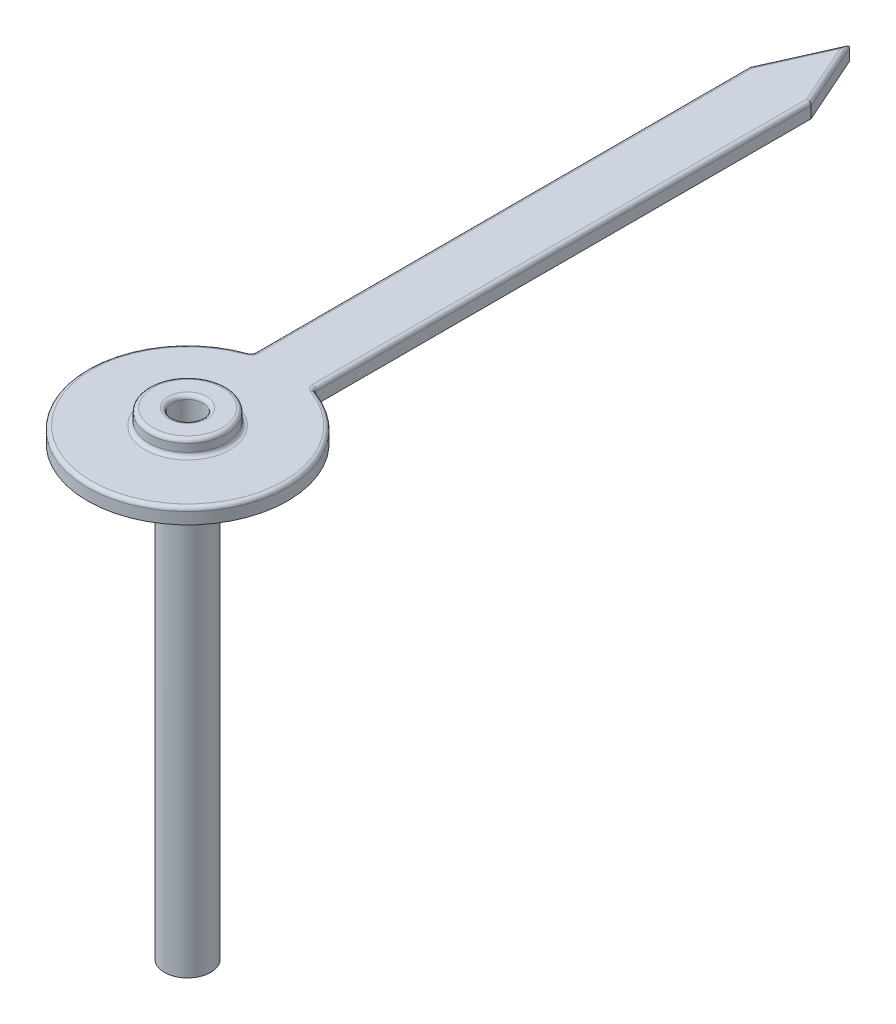
ISO-10303-21;
HEADER;
FILE_DESCRIPTION(('STEP AP214'),'2;1');
FILE_NAME('part.step','',(''),(''),'','','');
FILE_SCHEMA(('AUTOMOTIVE_DESIGN { 1 0 10303 214 1 1 1 1 }'));
ENDSEC;
DATA;
#1=APPLICATION_CONTEXT('core data for automotive mechanical design processes');
#2=APPLICATION_PROTOCOL_DEFINITION('international standard','automotive_design',2000,#1);
#3=PRODUCT_CONTEXT('',#1,'mechanical');
#4=PRODUCT('Part','Part','',(#3));
#5=PRODUCT_RELATED_PRODUCT_CATEGORY('part','',(#4));
#6=PRODUCT_DEFINITION_FORMATION('','',#4);
#7=PRODUCT_DEFINITION_CONTEXT('part definition',#1,'design');
#8=PRODUCT_DEFINITION('design','',#6,#7);
#9=PRODUCT_DEFINITION_SHAPE('','',#8);
#10=(LENGTH_UNIT() NAMED_UNIT(*) SI_UNIT(.MILLI.,.METRE.));
#11=(NAMED_UNIT(*) PLANE_ANGLE_UNIT() SI_UNIT($,.RADIAN.));
#12=(NAMED_UNIT(*) SI_UNIT($,.STERADIAN.) SOLID_ANGLE_UNIT());
#13=UNCERTAINTY_MEASURE_WITH_UNIT(LENGTH_MEASURE(1.E-05),#10,'distance_accuracy_value','');
#14=(GEOMETRIC_REPRESENTATION_CONTEXT(3) GLOBAL_UNCERTAINTY_ASSIGNED_CONTEXT((#13)) GLOBAL_UNIT_ASSIGNED_CONTEXT((#10,
#11,#12)) REPRESENTATION_CONTEXT('',''));
#15=CARTESIAN_POINT('',(0.,0.,0.));
#16=DIRECTION('',(0.,0.,1.));
#17=DIRECTION('',(1.,0.,0.));
#18=AXIS2_PLACEMENT_3D('',#15,#16,#17);
#19=CARTESIAN_POINT('',(-86.5194152002109,-2.9,39.6725020443444));
#20=DIRECTION('',(0.,1.,0.));
#21=DIRECTION('',(0.,0.,1.));
#22=AXIS2_PLACEMENT_3D('',#19,#20,#21);
#23=PLANE('',#22);
#24=CARTESIAN_POINT('',(-86.5194152002109,-2.9,39.6725020443444));
#25=DIRECTION('',(0.,1.,0.));
#26=DIRECTION('',(0.,0.,1.));
#27=AXIS2_PLACEMENT_3D('',#24,#25,#26);
#28=CIRCLE('',#27,0.100000000000009);
#29=CARTESIAN_POINT('',(-86.5194152002109,-2.9,39.7725020443444));
#30=VERTEX_POINT('',#29);
#31=EDGE_CURVE('E137',#30,#30,#28,.T.);
#32=ORIENTED_EDGE('',*,*,#31,.T.);
#33=EDGE_LOOP('',(#32));
#34=FACE_BOUND('',#33,.T.);
#35=CARTESIAN_POINT('',(-86.5194152002109,-2.9,39.6725020443444));
#36=DIRECTION('',(0.,-1.,0.));
#37=DIRECTION('',(0.,0.,-1.));
#38=AXIS2_PLACEMENT_3D('',#35,#36,#37);
#39=CIRCLE('',#38,0.149999999999991);
#40=CARTESIAN_POINT('',(-86.5194152002109,-2.9,39.5225020443444));
#41=VERTEX_POINT('',#40);
#42=EDGE_CURVE('E487',#41,#41,#39,.T.);
#43=ORIENTED_EDGE('',*,*,#42,.T.);
#44=EDGE_LOOP('',(#43));
#45=FACE_BOUND('',#44,.T.);
#46=ADVANCED_FACE('F33',(#34,#45),#23,.F.);
#47=CARTESIAN_POINT('',(-86.5194152002109,0.1,39.6725020443444));
#48=DIRECTION('',(0.,1.,0.));
#49=DIRECTION('',(0.,0.,1.));
#50=AXIS2_PLACEMENT_3D('',#47,#48,#49);
#51=PLANE('',#50);
#52=CARTESIAN_POINT('',(-86.7444152002109,0.1,39.0364527082737));
#53=DIRECTION('',(0.,1.,0.));
#54=DIRECTION('',(0.,0.,1.));
#55=AXIS2_PLACEMENT_3D('',#52,#53,#54);
#56=CIRCLE('',#55,0.05);
#57=CARTESIAN_POINT('',(-86.7277404574065,0.1,39.0835903042287));
#58=VERTEX_POINT('',#57);
#59=CARTESIAN_POINT('',(-86.6944152002109,0.1,39.0364527082737));
#60=VERTEX_POINT('',#59);
#61=EDGE_CURVE('E174',#58,#60,#56,.T.);
#62=ORIENTED_EDGE('',*,*,#61,.F.);
#63=CARTESIAN_POINT('',(-86.5194152002109,0.1,39.6725020443444));
#64=DIRECTION('',(0.,1.,0.));
#65=DIRECTION('',(0.,0.,1.));
#66=AXIS2_PLACEMENT_3D('',#63,#64,#65);
#67=CIRCLE('',#66,0.624673074841349);
#68=CARTESIAN_POINT('',(-86.3110899430152,0.1,39.0835903042287));
#69=VERTEX_POINT('',#68);
#70=EDGE_CURVE('E180',#58,#69,#67,.T.);
#71=ORIENTED_EDGE('',*,*,#70,.T.);
#72=CARTESIAN_POINT('',(-86.2944152002109,0.1,39.0364527082737));
#73=DIRECTION('',(0.,1.,0.));
#74=DIRECTION('',(0.,0.,1.));
#75=AXIS2_PLACEMENT_3D('',#72,#73,#74);
#76=CIRCLE('',#75,0.05);
#77=CARTESIAN_POINT('',(-86.3444152002109,0.1,39.0364527082737));
#78=VERTEX_POINT('',#77);
#79=EDGE_CURVE('E177',#78,#69,#76,.T.);
#80=ORIENTED_EDGE('',*,*,#79,.F.);
#81=DIRECTION('',(0.,0.,-1.));
#82=VECTOR('',#81,1.);
#83=CARTESIAN_POINT('',(-86.3444152002109,0.1,35.8249413528157));
#84=LINE('',#83,#82);
#85=CARTESIAN_POINT('',(-86.3444152002109,0.1,35.8302449444889));
#86=VERTEX_POINT('',#85);
#87=EDGE_CURVE('E171',#78,#86,#84,.T.);
#88=ORIENTED_EDGE('',*,*,#87,.T.);
#89=DIRECTION('',(-0.406014669859027,0.,-0.913866559109844));
#90=VECTOR('',#89,1.);
#91=CARTESIAN_POINT('',(-86.5422618641886,0.1,35.3849274142049));
#92=LINE('',#91,#90);
#93=CARTESIAN_POINT('',(-86.5194152002109,0.1,35.4363511773012));
#94=VERTEX_POINT('',#93);
#95=EDGE_CURVE('E165',#86,#94,#92,.T.);
#96=ORIENTED_EDGE('',*,*,#95,.T.);
#97=DIRECTION('',(-0.40601466985905,0.,0.913866559109833));
#98=VECTOR('',#97,1.);
#99=CARTESIAN_POINT('',(-86.6965685362331,0.1,35.8350917195622));
#100=LINE('',#99,#98);
#101=CARTESIAN_POINT('',(-86.6944152002109,0.1,35.8302449444889));
#102=VERTEX_POINT('',#101);
#103=EDGE_CURVE('E167',#94,#102,#100,.T.);
#104=ORIENTED_EDGE('',*,*,#103,.T.);
#105=DIRECTION('',(0.,0.,1.));
#106=VECTOR('',#105,1.);
#107=CARTESIAN_POINT('',(-86.6944152002109,0.1,39.0543798038661));
#108=LINE('',#107,#106);
#109=EDGE_CURVE('E169',#102,#60,#108,.T.);
#110=ORIENTED_EDGE('',*,*,#109,.T.);
#111=EDGE_LOOP('',(#62,#71,#80,#88,#96,#104,#110));
#112=FACE_BOUND('',#111,.T.);
#113=CARTESIAN_POINT('',(-86.5194152002109,0.1,39.6725020443444));
#114=DIRECTION('',(0.,1.,0.));
#115=DIRECTION('',(0.,0.,1.));
#116=AXIS2_PLACEMENT_3D('',#113,#114,#115);
#117=CIRCLE('',#116,0.275);
#118=CARTESIAN_POINT('',(-86.5194152002109,0.1,39.9475020443444));
#119=VERTEX_POINT('',#118);
#120=EDGE_CURVE('E162',#119,#119,#117,.F.);
#121=ORIENTED_EDGE('',*,*,#120,.T.);
#122=EDGE_LOOP('',(#121));
#123=FACE_BOUND('',#122,.T.);
#124=ADVANCED_FACE('F241',(#112,#123),#51,.T.);
#125=CARTESIAN_POINT('',(-86.5194152002109,0.,39.6725020443444));
#126=DIRECTION('',(0.,1.,0.));
#127=DIRECTION('',(0.,0.,1.));
#128=AXIS2_PLACEMENT_3D('',#125,#126,#127);
#129=PLANE('',#128);
#130=DIRECTION('',(-0.406014669859027,0.,-0.913866559109844));
#131=VECTOR('',#130,1.);
#132=CARTESIAN_POINT('',(-86.3194152002109,0.,35.8249413528157));
#133=LINE('',#132,#131);
#134=CARTESIAN_POINT('',(-86.3194152002109,0.,35.8249413528157));
#135=VERTEX_POINT('',#134);
#136=CARTESIAN_POINT('',(-86.5194152002109,0.,35.3747770474584));
#137=VERTEX_POINT('',#136);
#138=EDGE_CURVE('E130',#135,#137,#133,.T.);
#139=ORIENTED_EDGE('',*,*,#138,.F.);
#140=DIRECTION('',(0.,0.,-1.));
#141=VECTOR('',#140,1.);
#142=CARTESIAN_POINT('',(-86.3194152002109,0.,39.0543798038661));
#143=LINE('',#142,#141);
#144=CARTESIAN_POINT('',(-86.3194152002109,0.,39.0364527082737));
#145=VERTEX_POINT('',#144);
#146=EDGE_CURVE('E147',#145,#135,#143,.T.);
#147=ORIENTED_EDGE('',*,*,#146,.F.);
#148=CARTESIAN_POINT('',(-86.2944152002109,0.,39.0364527082737));
#149=DIRECTION('',(0.,1.,0.));
#150=DIRECTION('',(0.,0.,1.));
#151=AXIS2_PLACEMENT_3D('',#148,#149,#150);
#152=CIRCLE('',#151,0.025);
#153=CARTESIAN_POINT('',(-86.302752571613,0.,39.0600215062512));
#154=VERTEX_POINT('',#153);
#155=EDGE_CURVE('E11',#145,#154,#152,.T.);
#156=ORIENTED_EDGE('',*,*,#155,.T.);
#157=CARTESIAN_POINT('',(-86.5194152002109,0.,39.6725020443444));
#158=DIRECTION('',(0.,1.,0.));
#159=DIRECTION('',(0.,0.,1.));
#160=AXIS2_PLACEMENT_3D('',#157,#158,#159);
#161=CIRCLE('',#160,0.649673074841349);
#162=CARTESIAN_POINT('',(-86.7360778288087,0.,39.0600215062512));
#163=VERTEX_POINT('',#162);
#164=EDGE_CURVE('E144',#163,#154,#161,.T.);
#165=ORIENTED_EDGE('',*,*,#164,.F.);
#166=CARTESIAN_POINT('',(-86.7444152002109,0.,39.0364527082737));
#167=DIRECTION('',(0.,1.,0.));
#168=DIRECTION('',(0.,0.,1.));
#169=AXIS2_PLACEMENT_3D('',#166,#167,#168);
#170=CIRCLE('',#169,0.025);
#171=CARTESIAN_POINT('',(-86.7194152002109,0.,39.0364527082737));
#172=VERTEX_POINT('',#171);
#173=EDGE_CURVE('E42',#163,#172,#170,.T.);
#174=ORIENTED_EDGE('',*,*,#173,.T.);
#175=DIRECTION('',(0.,0.,1.));
#176=VECTOR('',#175,1.);
#177=CARTESIAN_POINT('',(-86.7194152002109,0.,39.0543798038661));
#178=LINE('',#177,#176);
#179=CARTESIAN_POINT('',(-86.7194152002109,0.,35.8249413528157));
#180=VERTEX_POINT('',#179);
#181=EDGE_CURVE('E131',#180,#172,#178,.T.);
#182=ORIENTED_EDGE('',*,*,#181,.F.);
#183=DIRECTION('',(-0.40601466985905,0.,0.913866559109833));
#184=VECTOR('',#183,1.);
#185=CARTESIAN_POINT('',(-86.5194152002109,0.,35.3747770474584));
#186=LINE('',#185,#184);
#187=EDGE_CURVE('E117',#137,#180,#186,.T.);
#188=ORIENTED_EDGE('',*,*,#187,.F.);
#189=EDGE_LOOP('',(#139,#147,#156,#165,#174,#182,#188));
#190=FACE_BOUND('',#189,.T.);
#191=CARTESIAN_POINT('',(-86.5194152002109,0.,39.6725020443444));
#192=DIRECTION('',(0.,1.,0.));
#193=DIRECTION('',(0.,0.,1.));
#194=AXIS2_PLACEMENT_3D('',#191,#192,#193);
#195=CIRCLE('',#194,0.149999999999991);
#196=CARTESIAN_POINT('',(-86.5194152002109,0.,39.8225020443443));
#197=VERTEX_POINT('',#196);
#198=EDGE_CURVE('E206',#197,#197,#195,.F.);
#199=ORIENTED_EDGE('',*,*,#198,.F.);
#200=EDGE_LOOP('',(#199));
#201=FACE_BOUND('',#200,.T.);
#202=ADVANCED_FACE('F127',(#190,#201),#129,.F.);
#203=CARTESIAN_POINT('',(-86.3194152002109,0.1,35.8249413528157));
#204=DIRECTION('',(-0.913866559109844,0.,0.406014669859027));
#205=DIRECTION('',(0.406014669859027,0.,0.913866559109844));
#206=AXIS2_PLACEMENT_3D('',#203,#204,#205);
#207=PLANE('',#206);
#208=DIRECTION('',(0.,-1.,0.));
#209=VECTOR('',#208,1.);
#210=CARTESIAN_POINT('',(-86.5194152002109,0.1,35.3747770474584));
#211=LINE('',#210,#209);
#212=CARTESIAN_POINT('',(-86.5194152002109,0.075,35.3747770474584));
#213=VERTEX_POINT('',#212);
#214=EDGE_CURVE('E114',#213,#137,#211,.T.);
#215=ORIENTED_EDGE('',*,*,#214,.F.);
#216=DIRECTION('',(-0.406014669859027,0.,-0.913866559109844));
#217=VECTOR('',#216,1.);
#218=CARTESIAN_POINT('',(-86.3194152002109,0.075,35.8249413528157));
#219=LINE('',#218,#217);
#220=CARTESIAN_POINT('',(-86.3194152002109,0.075,35.8249413528157));
#221=VERTEX_POINT('',#220);
#222=EDGE_CURVE('E197',#213,#221,#219,.F.);
#223=ORIENTED_EDGE('',*,*,#222,.T.);
#224=DIRECTION('',(0.,-1.,0.));
#225=VECTOR('',#224,1.);
#226=CARTESIAN_POINT('',(-86.3194152002109,0.1,35.8249413528157));
#227=LINE('',#226,#225);
#228=EDGE_CURVE('E135',#221,#135,#227,.T.);
#229=ORIENTED_EDGE('',*,*,#228,.T.);
#230=ORIENTED_EDGE('',*,*,#138,.T.);
#231=EDGE_LOOP('',(#215,#223,#229,#230));
#232=FACE_BOUND('',#231,.T.);
#233=ADVANCED_FACE('F133',(#232),#207,.F.);
#234=CARTESIAN_POINT('',(-86.5194152002109,0.1,35.3747770474584));
#235=DIRECTION('',(0.913866559109833,0.,0.40601466985905));
#236=DIRECTION('',(0.40601466985905,0.,-0.913866559109833));
#237=AXIS2_PLACEMENT_3D('',#234,#235,#236);
#238=PLANE('',#237);
#239=DIRECTION('',(0.,-1.,0.));
#240=VECTOR('',#239,1.);
#241=CARTESIAN_POINT('',(-86.7194152002109,0.1,35.8249413528157));
#242=LINE('',#241,#240);
#243=CARTESIAN_POINT('',(-86.7194152002109,0.075,35.8249413528157));
#244=VERTEX_POINT('',#243);
#245=EDGE_CURVE('E123',#244,#180,#242,.T.);
#246=ORIENTED_EDGE('',*,*,#245,.F.);
#247=DIRECTION('',(-0.40601466985905,0.,0.913866559109833));
#248=VECTOR('',#247,1.);
#249=CARTESIAN_POINT('',(-86.5194152002109,0.075,35.3747770474584));
#250=LINE('',#249,#248);
#251=EDGE_CURVE('E50',#244,#213,#250,.F.);
#252=ORIENTED_EDGE('',*,*,#251,.T.);
#253=ORIENTED_EDGE('',*,*,#214,.T.);
#254=ORIENTED_EDGE('',*,*,#187,.T.);
#255=EDGE_LOOP('',(#246,#252,#253,#254));
#256=FACE_BOUND('',#255,.T.);
#257=ADVANCED_FACE('F116',(#256),#238,.F.);
#258=CARTESIAN_POINT('',(-86.7194152002109,0.1,39.0543798038661));
#259=DIRECTION('',(1.,0.,0.));
#260=DIRECTION('',(0.,0.,-1.));
#261=AXIS2_PLACEMENT_3D('',#258,#259,#260);
#262=PLANE('',#261);
#263=DIRECTION('',(0.,1.,0.));
#264=VECTOR('',#263,1.);
#265=CARTESIAN_POINT('',(-86.7194152002109,0.1,39.0364527082737));
#266=LINE('',#265,#264);
#267=CARTESIAN_POINT('',(-86.7194152002109,0.075,39.0364527082737));
#268=VERTEX_POINT('',#267);
#269=EDGE_CURVE('E58',#172,#268,#266,.T.);
#270=ORIENTED_EDGE('',*,*,#269,.T.);
#271=DIRECTION('',(0.,0.,1.));
#272=VECTOR('',#271,1.);
#273=CARTESIAN_POINT('',(-86.7194152002109,0.075,35.8249413528157));
#274=LINE('',#273,#272);
#275=EDGE_CURVE('E194',#268,#244,#274,.F.);
#276=ORIENTED_EDGE('',*,*,#275,.T.);
#277=ORIENTED_EDGE('',*,*,#245,.T.);
#278=ORIENTED_EDGE('',*,*,#181,.T.);
#279=EDGE_LOOP('',(#270,#276,#277,#278));
#280=FACE_BOUND('',#279,.T.);
#281=ADVANCED_FACE('F272',(#280),#262,.F.);
#282=CARTESIAN_POINT('',(-86.5194152002109,0.1,39.6725020443444));
#283=DIRECTION('',(0.,-1.,0.));
#284=DIRECTION('',(0.,0.,-1.));
#285=AXIS2_PLACEMENT_3D('',#282,#283,#284);
#286=CYLINDRICAL_SURFACE('',#285,0.649673074841349);
#287=CARTESIAN_POINT('',(-86.5194152002109,0.075,39.6725020443444));
#288=DIRECTION('',(0.,1.,0.));
#289=DIRECTION('',(0.,0.,1.));
#290=AXIS2_PLACEMENT_3D('',#287,#288,#289);
#291=CIRCLE('',#290,0.649673074841349);
#292=CARTESIAN_POINT('',(-86.302752571613,0.075,39.0600215062512));
#293=VERTEX_POINT('',#292);
#294=CARTESIAN_POINT('',(-86.7360778288087,0.075,39.0600215062512));
#295=VERTEX_POINT('',#294);
#296=EDGE_CURVE('E189',#293,#295,#291,.F.);
#297=ORIENTED_EDGE('',*,*,#296,.T.);
#298=DIRECTION('',(0.,-1.,0.));
#299=VECTOR('',#298,1.);
#300=CARTESIAN_POINT('',(-86.7360778288087,0.1,39.0600215062512));
#301=LINE('',#300,#299);
#302=EDGE_CURVE('E191',#295,#163,#301,.T.);
#303=ORIENTED_EDGE('',*,*,#302,.T.);
#304=ORIENTED_EDGE('',*,*,#164,.T.);
#305=DIRECTION('',(0.,-1.,0.));
#306=VECTOR('',#305,1.);
#307=CARTESIAN_POINT('',(-86.302752571613,0.1,39.0600215062512));
#308=LINE('',#307,#306);
#309=EDGE_CURVE('E187',#154,#293,#308,.F.);
#310=ORIENTED_EDGE('',*,*,#309,.T.);
#311=EDGE_LOOP('',(#297,#303,#304,#310));
#312=FACE_BOUND('',#311,.T.);
#313=ADVANCED_FACE('F270',(#312),#286,.T.);
#314=CARTESIAN_POINT('',(-86.3194152002109,0.1,39.0543798038661));
#315=DIRECTION('',(-1.,0.,0.));
#316=DIRECTION('',(0.,0.,1.));
#317=AXIS2_PLACEMENT_3D('',#314,#315,#316);
#318=PLANE('',#317);
#319=ORIENTED_EDGE('',*,*,#228,.F.);
#320=DIRECTION('',(0.,0.,-1.));
#321=VECTOR('',#320,1.);
#322=CARTESIAN_POINT('',(-86.3194152002109,0.075,39.0543798038661));
#323=LINE('',#322,#321);
#324=CARTESIAN_POINT('',(-86.3194152002109,0.075,39.0364527082737));
#325=VERTEX_POINT('',#324);
#326=EDGE_CURVE('E184',#221,#325,#323,.F.);
#327=ORIENTED_EDGE('',*,*,#326,.T.);
#328=DIRECTION('',(0.,1.,0.));
#329=VECTOR('',#328,1.);
#330=CARTESIAN_POINT('',(-86.3194152002109,0.,39.0364527082737));
#331=LINE('',#330,#329);
#332=EDGE_CURVE('E182',#325,#145,#331,.F.);
#333=ORIENTED_EDGE('',*,*,#332,.T.);
#334=ORIENTED_EDGE('',*,*,#146,.T.);
#335=EDGE_LOOP('',(#319,#327,#333,#334));
#336=FACE_BOUND('',#335,.T.);
#337=ADVANCED_FACE('F256',(#336),#318,.F.);
#338=CARTESIAN_POINT('',(-86.5194152002109,0.1,39.6725020443444));
#339=DIRECTION('',(0.,-1.,0.));
#340=DIRECTION('',(0.,0.,-1.));
#341=AXIS2_PLACEMENT_3D('',#338,#339,#340);
#342=CYLINDRICAL_SURFACE('',#341,0.100000000000009);
#343=CARTESIAN_POINT('',(-86.5194152002109,0.175,39.6725020443444));
#344=DIRECTION('',(0.,1.,0.));
#345=DIRECTION('',(0.,0.,1.));
#346=AXIS2_PLACEMENT_3D('',#343,#344,#345);
#347=CIRCLE('',#346,0.100000000000009);
#348=CARTESIAN_POINT('',(-86.5194152002109,0.175,39.7725020443444));
#349=VERTEX_POINT('',#348);
#350=EDGE_CURVE('E122',#349,#349,#347,.T.);
#351=ORIENTED_EDGE('',*,*,#350,.T.);
#352=EDGE_LOOP('',(#351));
#353=FACE_BOUND('',#352,.T.);
#354=ORIENTED_EDGE('',*,*,#31,.F.);
#355=EDGE_LOOP('',(#354));
#356=FACE_BOUND('',#355,.T.);
#357=ADVANCED_FACE('F298',(#353,#356),#342,.F.);
#358=CARTESIAN_POINT('',(-86.5194152002109,-2.9,39.6725020443444));
#359=DIRECTION('',(0.,1.,0.));
#360=DIRECTION('',(0.,0.,1.));
#361=AXIS2_PLACEMENT_3D('',#358,#359,#360);
#362=CYLINDRICAL_SURFACE('',#361,0.25);
#363=CARTESIAN_POINT('',(-86.5194152002109,0.125,39.6725020443444));
#364=DIRECTION('',(0.,1.,0.));
#365=DIRECTION('',(0.,0.,1.));
#366=AXIS2_PLACEMENT_3D('',#363,#364,#365);
#367=CIRCLE('',#366,0.25);
#368=CARTESIAN_POINT('',(-86.5194152002109,0.125,39.9225020443444));
#369=VERTEX_POINT('',#368);
#370=EDGE_CURVE('E199',#369,#369,#367,.T.);
#371=ORIENTED_EDGE('',*,*,#370,.T.);
#372=EDGE_LOOP('',(#371));
#373=FACE_BOUND('',#372,.T.);
#374=CARTESIAN_POINT('',(-86.5194152002109,0.175,39.6725020443444));
#375=DIRECTION('',(0.,1.,0.));
#376=DIRECTION('',(0.,0.,1.));
#377=AXIS2_PLACEMENT_3D('',#374,#375,#376);
#378=CIRCLE('',#377,0.25);
#379=CARTESIAN_POINT('',(-86.5194152002109,0.175,39.9225020443444));
#380=VERTEX_POINT('',#379);
#381=EDGE_CURVE('E159',#380,#380,#378,.F.);
#382=ORIENTED_EDGE('',*,*,#381,.T.);
#383=EDGE_LOOP('',(#382));
#384=FACE_BOUND('',#383,.T.);
#385=ADVANCED_FACE('F295',(#373,#384),#362,.T.);
#386=CARTESIAN_POINT('',(-86.5194152002109,0.2,39.6725020443444));
#387=DIRECTION('',(0.,1.,0.));
#388=DIRECTION('',(0.,0.,1.));
#389=AXIS2_PLACEMENT_3D('',#386,#387,#388);
#390=PLANE('',#389);
#391=CARTESIAN_POINT('',(-86.5194152002109,0.2,39.6725020443444));
#392=DIRECTION('',(0.,1.,0.));
#393=DIRECTION('',(0.,0.,1.));
#394=AXIS2_PLACEMENT_3D('',#391,#392,#393);
#395=CIRCLE('',#394,0.125000000000009);
#396=CARTESIAN_POINT('',(-86.5194152002109,0.2,39.7975020443444));
#397=VERTEX_POINT('',#396);
#398=EDGE_CURVE('E156',#397,#397,#395,.F.);
#399=ORIENTED_EDGE('',*,*,#398,.T.);
#400=EDGE_LOOP('',(#399));
#401=FACE_BOUND('',#400,.T.);
#402=CARTESIAN_POINT('',(-86.5194152002109,0.2,39.6725020443444));
#403=DIRECTION('',(0.,1.,0.));
#404=DIRECTION('',(0.,0.,1.));
#405=AXIS2_PLACEMENT_3D('',#402,#403,#404);
#406=CIRCLE('',#405,0.225);
#407=CARTESIAN_POINT('',(-86.5194152002109,0.2,39.8975020443444));
#408=VERTEX_POINT('',#407);
#409=EDGE_CURVE('E153',#408,#408,#406,.T.);
#410=ORIENTED_EDGE('',*,*,#409,.T.);
#411=EDGE_LOOP('',(#410));
#412=FACE_BOUND('',#411,.T.);
#413=ADVANCED_FACE('F293',(#401,#412),#390,.T.);
#414=CARTESIAN_POINT('',(-86.5194152002109,0.175,39.6725020443444));
#415=DIRECTION('',(0.,1.,0.));
#416=DIRECTION('',(0.,0.,1.));
#417=AXIS2_PLACEMENT_3D('',#414,#415,#416);
#418=TOROIDAL_SURFACE('',#417,0.125000000000009,0.025);
#419=ORIENTED_EDGE('',*,*,#398,.F.);
#420=EDGE_LOOP('',(#419));
#421=FACE_BOUND('',#420,.T.);
#422=ORIENTED_EDGE('',*,*,#350,.F.);
#423=EDGE_LOOP('',(#422));
#424=FACE_BOUND('',#423,.T.);
#425=ADVANCED_FACE('F325',(#421,#424),#418,.T.);
#426=CARTESIAN_POINT('',(-86.5194152002109,0.175,39.6725020443444));
#427=DIRECTION('',(0.,1.,0.));
#428=DIRECTION('',(0.,0.,1.));
#429=AXIS2_PLACEMENT_3D('',#426,#427,#428);
#430=TOROIDAL_SURFACE('',#429,0.225,0.025);
#431=ORIENTED_EDGE('',*,*,#381,.F.);
#432=EDGE_LOOP('',(#431));
#433=FACE_BOUND('',#432,.T.);
#434=ORIENTED_EDGE('',*,*,#409,.F.);
#435=EDGE_LOOP('',(#434));
#436=FACE_BOUND('',#435,.T.);
#437=ADVANCED_FACE('F332',(#433,#436),#430,.T.);
#438=CARTESIAN_POINT('',(-86.7444152002109,0.1,39.0364527082737));
#439=DIRECTION('',(0.,-1.,0.));
#440=DIRECTION('',(0.,0.,-1.));
#441=AXIS2_PLACEMENT_3D('',#438,#439,#440);
#442=CYLINDRICAL_SURFACE('',#441,0.025);
#443=CARTESIAN_POINT('',(-86.7444152002109,0.075,39.0364527082737));
#444=DIRECTION('',(0.,1.,0.));
#445=DIRECTION('',(0.,0.,1.));
#446=AXIS2_PLACEMENT_3D('',#443,#444,#445);
#447=CIRCLE('',#446,0.025);
#448=EDGE_CURVE('E37',#268,#295,#447,.F.);
#449=ORIENTED_EDGE('',*,*,#448,.F.);
#450=ORIENTED_EDGE('',*,*,#269,.F.);
#451=ORIENTED_EDGE('',*,*,#173,.F.);
#452=ORIENTED_EDGE('',*,*,#302,.F.);
#453=EDGE_LOOP('',(#449,#450,#451,#452));
#454=FACE_BOUND('',#453,.T.);
#455=ADVANCED_FACE('F271',(#454),#442,.F.);
#456=CARTESIAN_POINT('',(-86.7444152002109,0.075,39.0364527082737));
#457=DIRECTION('',(0.,1.,0.));
#458=DIRECTION('',(0.,0.,1.));
#459=AXIS2_PLACEMENT_3D('',#456,#457,#458);
#460=TOROIDAL_SURFACE('',#459,0.05,0.025);
#461=CARTESIAN_POINT('',(-86.7277404574065,0.075,39.0835903042287));
#462=DIRECTION('',(0.94275191909835,0.,-0.333494856086834));
#463=DIRECTION('',(-0.333494856086834,0.,-0.94275191909835));
#464=AXIS2_PLACEMENT_3D('',#461,#462,#463);
#465=CIRCLE('',#464,0.025);
#466=EDGE_CURVE('E220',#58,#295,#465,.F.);
#467=ORIENTED_EDGE('',*,*,#466,.F.);
#468=ORIENTED_EDGE('',*,*,#61,.T.);
#469=CARTESIAN_POINT('',(-86.6944152002109,0.075,39.0364527082737));
#470=DIRECTION('',(0.,0.,1.));
#471=DIRECTION('',(1.,0.,0.));
#472=AXIS2_PLACEMENT_3D('',#469,#470,#471);
#473=CIRCLE('',#472,0.025);
#474=EDGE_CURVE('E222',#268,#60,#473,.F.);
#475=ORIENTED_EDGE('',*,*,#474,.F.);
#476=ORIENTED_EDGE('',*,*,#448,.T.);
#477=EDGE_LOOP('',(#467,#468,#475,#476));
#478=FACE_BOUND('',#477,.T.);
#479=ADVANCED_FACE('F231',(#478),#460,.T.);
#480=CARTESIAN_POINT('',(-86.6944152002109,0.075,39.6725020443444));
#481=DIRECTION('',(0.,0.,-1.));
#482=DIRECTION('',(-1.,0.,0.));
#483=AXIS2_PLACEMENT_3D('',#480,#481,#482);
#484=CYLINDRICAL_SURFACE('',#483,0.025);
#485=ORIENTED_EDGE('',*,*,#474,.T.);
#486=ORIENTED_EDGE('',*,*,#109,.F.);
#487=CARTESIAN_POINT('',(-86.6944152002109,0.075,35.8302449444889));
#488=DIRECTION('',(0.207525228454478,0.,-0.978229666057474));
#489=DIRECTION('',(0.978229666057474,0.,0.207525228454478));
#490=AXIS2_PLACEMENT_3D('',#487,#488,#489);
#491=ELLIPSE('',#490,0.0255563707250432,0.025);
#492=EDGE_CURVE('E217',#244,#102,#491,.T.);
#493=ORIENTED_EDGE('',*,*,#492,.F.);
#494=ORIENTED_EDGE('',*,*,#275,.F.);
#495=EDGE_LOOP('',(#485,#486,#493,#494));
#496=FACE_BOUND('',#495,.T.);
#497=ADVANCED_FACE('F246',(#496),#484,.T.);
#498=CARTESIAN_POINT('',(-86.2944152002109,0.1,39.0364527082737));
#499=DIRECTION('',(0.,-1.,0.));
#500=DIRECTION('',(0.,0.,-1.));
#501=AXIS2_PLACEMENT_3D('',#498,#499,#500);
#502=CYLINDRICAL_SURFACE('',#501,0.025);
#503=ORIENTED_EDGE('',*,*,#155,.F.);
#504=ORIENTED_EDGE('',*,*,#332,.F.);
#505=CARTESIAN_POINT('',(-86.2944152002109,0.075,39.0364527082737));
#506=DIRECTION('',(0.,1.,0.));
#507=DIRECTION('',(0.,0.,1.));
#508=AXIS2_PLACEMENT_3D('',#505,#506,#507);
#509=CIRCLE('',#508,0.025);
#510=EDGE_CURVE('E214',#293,#325,#509,.F.);
#511=ORIENTED_EDGE('',*,*,#510,.F.);
#512=ORIENTED_EDGE('',*,*,#309,.F.);
#513=EDGE_LOOP('',(#503,#504,#511,#512));
#514=FACE_BOUND('',#513,.T.);
#515=ADVANCED_FACE('F266',(#514),#502,.F.);
#516=CARTESIAN_POINT('',(-86.5194152002109,0.075,39.6725020443444));
#517=DIRECTION('',(0.,1.,0.));
#518=DIRECTION('',(0.,0.,1.));
#519=AXIS2_PLACEMENT_3D('',#516,#517,#518);
#520=TOROIDAL_SURFACE('',#519,0.624673074841349,0.025);
#521=ORIENTED_EDGE('',*,*,#466,.T.);
#522=ORIENTED_EDGE('',*,*,#296,.F.);
#523=CARTESIAN_POINT('',(-86.3110899430152,0.075,39.0835903042287));
#524=DIRECTION('',(-0.94275191909835,0.,-0.333494856086834));
#525=DIRECTION('',(-0.333494856086834,0.,0.94275191909835));
#526=AXIS2_PLACEMENT_3D('',#523,#524,#525);
#527=CIRCLE('',#526,0.025);
#528=EDGE_CURVE('E211',#69,#293,#527,.T.);
#529=ORIENTED_EDGE('',*,*,#528,.F.);
#530=ORIENTED_EDGE('',*,*,#70,.F.);
#531=EDGE_LOOP('',(#521,#522,#529,#530));
#532=FACE_BOUND('',#531,.T.);
#533=ADVANCED_FACE('F237',(#532),#520,.T.);
#534=CARTESIAN_POINT('',(-88.0912102976875,0.075,38.9741814183991));
#535=DIRECTION('',(0.40601466985905,0.,-0.913866559109833));
#536=DIRECTION('',(-0.913866559109833,0.,-0.40601466985905));
#537=AXIS2_PLACEMENT_3D('',#534,#535,#536);
#538=CYLINDRICAL_SURFACE('',#537,0.025);
#539=ORIENTED_EDGE('',*,*,#492,.T.);
#540=ORIENTED_EDGE('',*,*,#103,.F.);
#541=CARTESIAN_POINT('',(-86.5194152002109,0.075,35.4363511773012));
#542=DIRECTION('',(1.,0.,0.));
#543=DIRECTION('',(0.,0.,1.));
#544=AXIS2_PLACEMENT_3D('',#541,#542,#543);
#545=ELLIPSE('',#544,0.0615741298428444,0.025);
#546=EDGE_CURVE('E208',#213,#94,#545,.T.);
#547=ORIENTED_EDGE('',*,*,#546,.F.);
#548=ORIENTED_EDGE('',*,*,#251,.F.);
#549=EDGE_LOOP('',(#539,#540,#547,#548));
#550=FACE_BOUND('',#549,.T.);
#551=ADVANCED_FACE('F248',(#550),#538,.T.);
#552=CARTESIAN_POINT('',(-86.2944152002109,0.075,39.0364527082737));
#553=DIRECTION('',(0.,1.,0.));
#554=DIRECTION('',(0.,0.,1.));
#555=AXIS2_PLACEMENT_3D('',#552,#553,#554);
#556=TOROIDAL_SURFACE('',#555,0.05,0.025);
#557=ORIENTED_EDGE('',*,*,#528,.T.);
#558=ORIENTED_EDGE('',*,*,#510,.T.);
#559=CARTESIAN_POINT('',(-86.3444152002109,0.075,39.0364527082737));
#560=DIRECTION('',(0.,0.,1.));
#561=DIRECTION('',(1.,0.,0.));
#562=AXIS2_PLACEMENT_3D('',#559,#560,#561);
#563=CIRCLE('',#562,0.025);
#564=EDGE_CURVE('E205',#78,#325,#563,.F.);
#565=ORIENTED_EDGE('',*,*,#564,.F.);
#566=ORIENTED_EDGE('',*,*,#79,.T.);
#567=EDGE_LOOP('',(#557,#558,#565,#566));
#568=FACE_BOUND('',#567,.T.);
#569=ADVANCED_FACE('F262',(#568),#556,.T.);
#570=CARTESIAN_POINT('',(-84.9476201027343,0.075,38.9741814183991));
#571=DIRECTION('',(0.406014669859027,0.,0.913866559109844));
#572=DIRECTION('',(0.913866559109844,0.,-0.406014669859027));
#573=AXIS2_PLACEMENT_3D('',#570,#571,#572);
#574=CYLINDRICAL_SURFACE('',#573,0.025);
#575=ORIENTED_EDGE('',*,*,#546,.T.);
#576=ORIENTED_EDGE('',*,*,#95,.F.);
#577=CARTESIAN_POINT('',(-86.3444152002109,0.075,35.8302449444889));
#578=DIRECTION('',(0.207525228454465,0.,0.978229666057476));
#579=DIRECTION('',(0.978229666057477,0.,-0.207525228454465));
#580=AXIS2_PLACEMENT_3D('',#577,#578,#579);
#581=ELLIPSE('',#580,0.0255563707250431,0.025);
#582=EDGE_CURVE('E203',#221,#86,#581,.T.);
#583=ORIENTED_EDGE('',*,*,#582,.F.);
#584=ORIENTED_EDGE('',*,*,#222,.F.);
#585=EDGE_LOOP('',(#575,#576,#583,#584));
#586=FACE_BOUND('',#585,.T.);
#587=ADVANCED_FACE('F253',(#586),#574,.T.);
#588=CARTESIAN_POINT('',(-86.3444152002109,0.075,39.6725020443444));
#589=DIRECTION('',(0.,0.,1.));
#590=DIRECTION('',(1.,0.,0.));
#591=AXIS2_PLACEMENT_3D('',#588,#589,#590);
#592=CYLINDRICAL_SURFACE('',#591,0.025);
#593=ORIENTED_EDGE('',*,*,#564,.T.);
#594=ORIENTED_EDGE('',*,*,#326,.F.);
#595=ORIENTED_EDGE('',*,*,#582,.T.);
#596=ORIENTED_EDGE('',*,*,#87,.F.);
#597=EDGE_LOOP('',(#593,#594,#595,#596));
#598=FACE_BOUND('',#597,.T.);
#599=ADVANCED_FACE('F258',(#598),#592,.T.);
#600=CARTESIAN_POINT('',(-86.5194152002109,0.125,39.6725020443444));
#601=DIRECTION('',(0.,1.,0.));
#602=DIRECTION('',(0.,0.,1.));
#603=AXIS2_PLACEMENT_3D('',#600,#601,#602);
#604=TOROIDAL_SURFACE('',#603,0.275,0.025);
#605=ORIENTED_EDGE('',*,*,#120,.F.);
#606=EDGE_LOOP('',(#605));
#607=FACE_BOUND('',#606,.T.);
#608=ORIENTED_EDGE('',*,*,#370,.F.);
#609=EDGE_LOOP('',(#608));
#610=FACE_BOUND('',#609,.T.);
#611=ADVANCED_FACE('F35',(#607,#610),#604,.F.);
#612=CARTESIAN_POINT('',(-86.5194152002109,1.04095722126043,39.6725020443444));
#613=DIRECTION('',(0.,-1.,0.));
#614=DIRECTION('',(0.,0.,-1.));
#615=AXIS2_PLACEMENT_3D('',#612,#613,#614);
#616=CYLINDRICAL_SURFACE('',#615,0.149999999999991);
#617=ORIENTED_EDGE('',*,*,#42,.F.);
#618=EDGE_LOOP('',(#617));
#619=FACE_BOUND('',#618,.T.);
#620=ORIENTED_EDGE('',*,*,#198,.T.);
#621=EDGE_LOOP('',(#620));
#622=FACE_BOUND('',#621,.T.);
#623=ADVANCED_FACE('F399',(#619,#622),#616,.T.);
#624=CLOSED_SHELL('',(#46,#124,#202,#233,#257,#281,#313,#337,#357,#385,#413,#425,#437,#455,#479,
#497,#515,#533,#551,#569,#587,#599,#611,#623));
#625=MANIFOLD_SOLID_BREP('B2',#624);
#626=ADVANCED_BREP_SHAPE_REPRESENTATION('',(#18,#625),#14);
#627=SHAPE_DEFINITION_REPRESENTATION(#9,#626);
ENDSEC;
END-ISO-10303-21;
